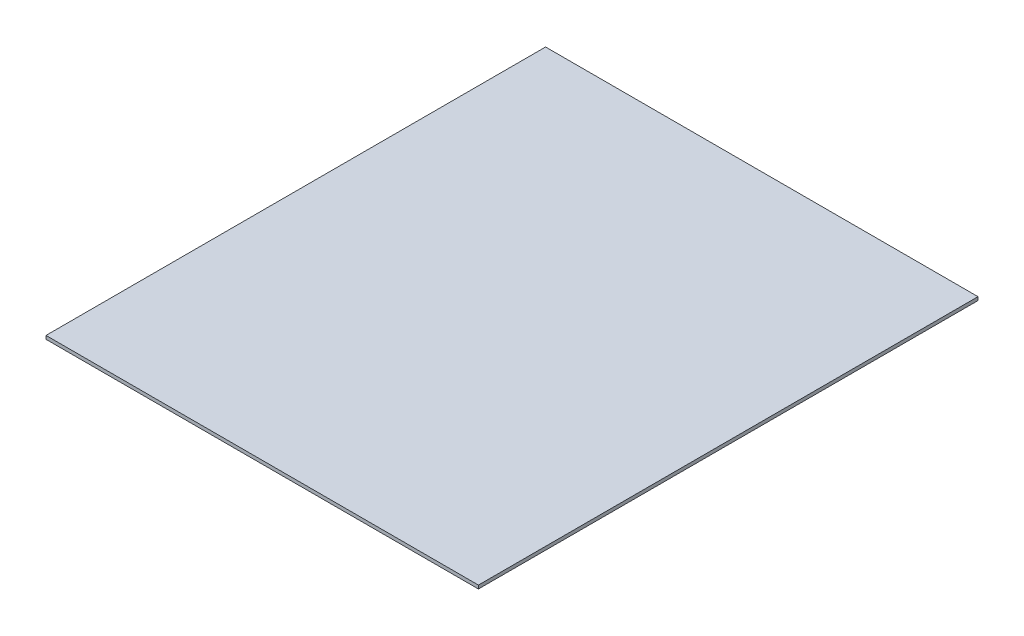
ISO-10303-21;
HEADER;
FILE_DESCRIPTION(('STEP AP214'),'2;1');
FILE_NAME('part.step','',(''),(''),'','','');
FILE_SCHEMA(('AUTOMOTIVE_DESIGN { 1 0 10303 214 1 1 1 1 }'));
ENDSEC;
DATA;
#1=APPLICATION_CONTEXT('core data for automotive mechanical design processes');
#2=APPLICATION_PROTOCOL_DEFINITION('international standard','automotive_design',2000,#1);
#3=PRODUCT_CONTEXT('',#1,'mechanical');
#4=PRODUCT('Part','Part','',(#3));
#5=PRODUCT_RELATED_PRODUCT_CATEGORY('part','',(#4));
#6=PRODUCT_DEFINITION_FORMATION('','',#4);
#7=PRODUCT_DEFINITION_CONTEXT('part definition',#1,'design');
#8=PRODUCT_DEFINITION('design','',#6,#7);
#9=PRODUCT_DEFINITION_SHAPE('','',#8);
#10=(LENGTH_UNIT() NAMED_UNIT(*) SI_UNIT(.MILLI.,.METRE.));
#11=(NAMED_UNIT(*) PLANE_ANGLE_UNIT() SI_UNIT($,.RADIAN.));
#12=(NAMED_UNIT(*) SI_UNIT($,.STERADIAN.) SOLID_ANGLE_UNIT());
#13=UNCERTAINTY_MEASURE_WITH_UNIT(LENGTH_MEASURE(1.E-05),#10,'distance_accuracy_value','');
#14=(GEOMETRIC_REPRESENTATION_CONTEXT(3) GLOBAL_UNCERTAINTY_ASSIGNED_CONTEXT((#13)) GLOBAL_UNIT_ASSIGNED_CONTEXT((#10,
#11,#12)) REPRESENTATION_CONTEXT('',''));
#15=CARTESIAN_POINT('',(0.,0.,0.));
#16=DIRECTION('',(0.,0.,1.));
#17=DIRECTION('',(1.,0.,0.));
#18=AXIS2_PLACEMENT_3D('',#15,#16,#17);
#19=CARTESIAN_POINT('',(190.,3.,219.5));
#20=DIRECTION('',(-1.,0.,0.));
#21=DIRECTION('',(0.,0.,1.));
#22=AXIS2_PLACEMENT_3D('',#19,#20,#21);
#23=PLANE('',#22);
#24=DIRECTION('',(0.,0.,-1.));
#25=VECTOR('',#24,1.);
#26=CARTESIAN_POINT('',(190.,0.,219.5));
#27=LINE('',#26,#25);
#28=CARTESIAN_POINT('',(190.,0.,219.5));
#29=VERTEX_POINT('',#28);
#30=CARTESIAN_POINT('',(190.,0.,-219.5));
#31=VERTEX_POINT('',#30);
#32=EDGE_CURVE('E98',#29,#31,#27,.T.);
#33=ORIENTED_EDGE('',*,*,#32,.T.);
#34=DIRECTION('',(0.,-1.,0.));
#35=VECTOR('',#34,1.);
#36=CARTESIAN_POINT('',(190.,3.,-219.5));
#37=LINE('',#36,#35);
#38=CARTESIAN_POINT('',(190.,3.,-219.5));
#39=VERTEX_POINT('',#38);
#40=EDGE_CURVE('E11',#39,#31,#37,.T.);
#41=ORIENTED_EDGE('',*,*,#40,.F.);
#42=DIRECTION('',(0.,0.,-1.));
#43=VECTOR('',#42,1.);
#44=CARTESIAN_POINT('',(190.,3.,219.5));
#45=LINE('',#44,#43);
#46=CARTESIAN_POINT('',(190.,3.,219.5));
#47=VERTEX_POINT('',#46);
#48=EDGE_CURVE('E86',#47,#39,#45,.T.);
#49=ORIENTED_EDGE('',*,*,#48,.F.);
#50=DIRECTION('',(0.,-1.,0.));
#51=VECTOR('',#50,1.);
#52=CARTESIAN_POINT('',(190.,3.,219.5));
#53=LINE('',#52,#51);
#54=EDGE_CURVE('E94',#47,#29,#53,.T.);
#55=ORIENTED_EDGE('',*,*,#54,.T.);
#56=EDGE_LOOP('',(#33,#41,#49,#55));
#57=FACE_BOUND('',#56,.T.);
#58=ADVANCED_FACE('F35',(#57),#23,.F.);
#59=CARTESIAN_POINT('',(-190.,3.,-219.5));
#60=DIRECTION('',(0.,0.,1.));
#61=DIRECTION('',(1.,0.,0.));
#62=AXIS2_PLACEMENT_3D('',#59,#60,#61);
#63=PLANE('',#62);
#64=DIRECTION('',(-1.,0.,0.));
#65=VECTOR('',#64,1.);
#66=CARTESIAN_POINT('',(-190.,0.,-219.5));
#67=LINE('',#66,#65);
#68=CARTESIAN_POINT('',(-190.,0.,-219.5));
#69=VERTEX_POINT('',#68);
#70=EDGE_CURVE('E90',#31,#69,#67,.T.);
#71=ORIENTED_EDGE('',*,*,#70,.T.);
#72=DIRECTION('',(0.,-1.,0.));
#73=VECTOR('',#72,1.);
#74=CARTESIAN_POINT('',(-190.,3.,-219.5));
#75=LINE('',#74,#73);
#76=CARTESIAN_POINT('',(-190.,3.,-219.5));
#77=VERTEX_POINT('',#76);
#78=EDGE_CURVE('E43',#77,#69,#75,.T.);
#79=ORIENTED_EDGE('',*,*,#78,.F.);
#80=DIRECTION('',(-1.,0.,0.));
#81=VECTOR('',#80,1.);
#82=CARTESIAN_POINT('',(-190.,3.,-219.5));
#83=LINE('',#82,#81);
#84=EDGE_CURVE('E81',#39,#77,#83,.T.);
#85=ORIENTED_EDGE('',*,*,#84,.F.);
#86=ORIENTED_EDGE('',*,*,#40,.T.);
#87=EDGE_LOOP('',(#71,#79,#85,#86));
#88=FACE_BOUND('',#87,.T.);
#89=ADVANCED_FACE('F89',(#88),#63,.F.);
#90=CARTESIAN_POINT('',(-190.,3.,219.5));
#91=DIRECTION('',(1.,0.,0.));
#92=DIRECTION('',(0.,0.,-1.));
#93=AXIS2_PLACEMENT_3D('',#90,#91,#92);
#94=PLANE('',#93);
#95=DIRECTION('',(0.,0.,1.));
#96=VECTOR('',#95,1.);
#97=CARTESIAN_POINT('',(-190.,0.,219.5));
#98=LINE('',#97,#96);
#99=CARTESIAN_POINT('',(-190.,0.,219.5));
#100=VERTEX_POINT('',#99);
#101=EDGE_CURVE('E68',#69,#100,#98,.T.);
#102=ORIENTED_EDGE('',*,*,#101,.T.);
#103=DIRECTION('',(0.,-1.,0.));
#104=VECTOR('',#103,1.);
#105=CARTESIAN_POINT('',(-190.,3.,219.5));
#106=LINE('',#105,#104);
#107=CARTESIAN_POINT('',(-190.,3.,219.5));
#108=VERTEX_POINT('',#107);
#109=EDGE_CURVE('E91',#108,#100,#106,.T.);
#110=ORIENTED_EDGE('',*,*,#109,.F.);
#111=DIRECTION('',(0.,0.,1.));
#112=VECTOR('',#111,1.);
#113=CARTESIAN_POINT('',(-190.,3.,219.5));
#114=LINE('',#113,#112);
#115=EDGE_CURVE('E84',#77,#108,#114,.T.);
#116=ORIENTED_EDGE('',*,*,#115,.F.);
#117=ORIENTED_EDGE('',*,*,#78,.T.);
#118=EDGE_LOOP('',(#102,#110,#116,#117));
#119=FACE_BOUND('',#118,.T.);
#120=ADVANCED_FACE('F92',(#119),#94,.F.);
#121=CARTESIAN_POINT('',(-190.,3.,219.5));
#122=DIRECTION('',(0.,0.,-1.));
#123=DIRECTION('',(-1.,0.,0.));
#124=AXIS2_PLACEMENT_3D('',#121,#122,#123);
#125=PLANE('',#124);
#126=DIRECTION('',(1.,0.,0.));
#127=VECTOR('',#126,1.);
#128=CARTESIAN_POINT('',(-190.,0.,219.5));
#129=LINE('',#128,#127);
#130=EDGE_CURVE('E74',#100,#29,#129,.T.);
#131=ORIENTED_EDGE('',*,*,#130,.T.);
#132=ORIENTED_EDGE('',*,*,#54,.F.);
#133=DIRECTION('',(1.,0.,0.));
#134=VECTOR('',#133,1.);
#135=CARTESIAN_POINT('',(-190.,3.,219.5));
#136=LINE('',#135,#134);
#137=EDGE_CURVE('E51',#108,#47,#136,.T.);
#138=ORIENTED_EDGE('',*,*,#137,.F.);
#139=ORIENTED_EDGE('',*,*,#109,.T.);
#140=EDGE_LOOP('',(#131,#132,#138,#139));
#141=FACE_BOUND('',#140,.T.);
#142=ADVANCED_FACE('F105',(#141),#125,.F.);
#143=CARTESIAN_POINT('',(0.,3.,0.));
#144=DIRECTION('',(0.,-1.,0.));
#145=DIRECTION('',(0.,0.,-1.));
#146=AXIS2_PLACEMENT_3D('',#143,#144,#145);
#147=PLANE('',#146);
#148=ORIENTED_EDGE('',*,*,#48,.T.);
#149=ORIENTED_EDGE('',*,*,#84,.T.);
#150=ORIENTED_EDGE('',*,*,#115,.T.);
#151=ORIENTED_EDGE('',*,*,#137,.T.);
#152=EDGE_LOOP('',(#148,#149,#150,#151));
#153=FACE_BOUND('',#152,.T.);
#154=ADVANCED_FACE('F82',(#153),#147,.F.);
#155=CARTESIAN_POINT('',(0.,0.,0.));
#156=DIRECTION('',(0.,-1.,0.));
#157=DIRECTION('',(0.,0.,-1.));
#158=AXIS2_PLACEMENT_3D('',#155,#156,#157);
#159=PLANE('',#158);
#160=ORIENTED_EDGE('',*,*,#32,.F.);
#161=ORIENTED_EDGE('',*,*,#130,.F.);
#162=ORIENTED_EDGE('',*,*,#101,.F.);
#163=ORIENTED_EDGE('',*,*,#70,.F.);
#164=EDGE_LOOP('',(#160,#161,#162,#163));
#165=FACE_BOUND('',#164,.T.);
#166=ADVANCED_FACE('F108',(#165),#159,.T.);
#167=CLOSED_SHELL('',(#58,#89,#120,#142,#154,#166));
#168=MANIFOLD_SOLID_BREP('B2',#167);
#169=ADVANCED_BREP_SHAPE_REPRESENTATION('',(#18,#168),#14);
#170=SHAPE_DEFINITION_REPRESENTATION(#9,#169);
ENDSEC;
END-ISO-10303-21;
